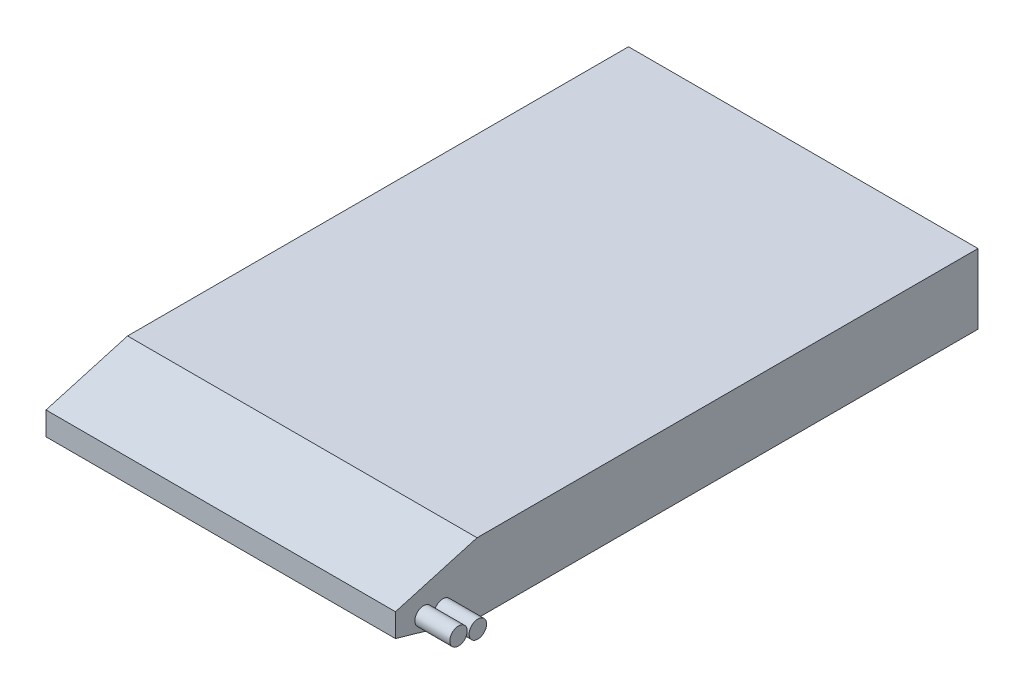
ISO-10303-21;
HEADER;
FILE_DESCRIPTION(('STEP AP214'),'2;1');
FILE_NAME('part.step','',(''),(''),'','','');
FILE_SCHEMA(('AUTOMOTIVE_DESIGN { 1 0 10303 214 1 1 1 1 }'));
ENDSEC;
DATA;
#1=APPLICATION_CONTEXT('core data for automotive mechanical design processes');
#2=APPLICATION_PROTOCOL_DEFINITION('international standard','automotive_design',2000,#1);
#3=PRODUCT_CONTEXT('',#1,'mechanical');
#4=PRODUCT('Part','Part','',(#3));
#5=PRODUCT_RELATED_PRODUCT_CATEGORY('part','',(#4));
#6=PRODUCT_DEFINITION_FORMATION('','',#4);
#7=PRODUCT_DEFINITION_CONTEXT('part definition',#1,'design');
#8=PRODUCT_DEFINITION('design','',#6,#7);
#9=PRODUCT_DEFINITION_SHAPE('','',#8);
#10=(LENGTH_UNIT() NAMED_UNIT(*) SI_UNIT(.MILLI.,.METRE.));
#11=(NAMED_UNIT(*) PLANE_ANGLE_UNIT() SI_UNIT($,.RADIAN.));
#12=(NAMED_UNIT(*) SI_UNIT($,.STERADIAN.) SOLID_ANGLE_UNIT());
#13=UNCERTAINTY_MEASURE_WITH_UNIT(LENGTH_MEASURE(1.E-05),#10,'distance_accuracy_value','');
#14=(GEOMETRIC_REPRESENTATION_CONTEXT(3) GLOBAL_UNCERTAINTY_ASSIGNED_CONTEXT((#13)) GLOBAL_UNIT_ASSIGNED_CONTEXT((#10,
#11,#12)) REPRESENTATION_CONTEXT('',''));
#15=CARTESIAN_POINT('',(0.,0.,0.));
#16=DIRECTION('',(0.,0.,1.));
#17=DIRECTION('',(1.,0.,0.));
#18=AXIS2_PLACEMENT_3D('',#15,#16,#17);
#19=CARTESIAN_POINT('',(-15.,6.,-25.));
#20=DIRECTION('',(1.,0.,0.));
#21=DIRECTION('',(0.,0.,-1.));
#22=AXIS2_PLACEMENT_3D('',#19,#20,#21);
#23=PLANE('',#22);
#24=DIRECTION('',(0.,0.,1.));
#25=VECTOR('',#24,1.);
#26=CARTESIAN_POINT('',(-15.,0.,-25.));
#27=LINE('',#26,#25);
#28=CARTESIAN_POINT('',(-15.,0.,-25.));
#29=VERTEX_POINT('',#28);
#30=CARTESIAN_POINT('',(-15.,0.,18.));
#31=VERTEX_POINT('',#30);
#32=EDGE_CURVE('E119',#29,#31,#27,.T.);
#33=ORIENTED_EDGE('',*,*,#32,.T.);
#34=DIRECTION('',(0.,-0.274721127897378,-0.961523947640823));
#35=VECTOR('',#34,1.);
#36=CARTESIAN_POINT('',(-15.,2.,25.));
#37=LINE('',#36,#35);
#38=CARTESIAN_POINT('',(-15.,2.,25.));
#39=VERTEX_POINT('',#38);
#40=EDGE_CURVE('E140',#31,#39,#37,.F.);
#41=ORIENTED_EDGE('',*,*,#40,.T.);
#42=DIRECTION('',(0.,-1.,0.));
#43=VECTOR('',#42,1.);
#44=CARTESIAN_POINT('',(-15.,6.,25.));
#45=LINE('',#44,#43);
#46=CARTESIAN_POINT('',(-15.,4.,25.));
#47=VERTEX_POINT('',#46);
#48=EDGE_CURVE('E126',#47,#39,#45,.T.);
#49=ORIENTED_EDGE('',*,*,#48,.F.);
#50=DIRECTION('',(0.,0.274721127897375,-0.961523947640824));
#51=VECTOR('',#50,1.);
#52=CARTESIAN_POINT('',(-15.,6.,17.9999999999999));
#53=LINE('',#52,#51);
#54=CARTESIAN_POINT('',(-15.,6.,17.9999999999999));
#55=VERTEX_POINT('',#54);
#56=EDGE_CURVE('E50',#47,#55,#53,.T.);
#57=ORIENTED_EDGE('',*,*,#56,.T.);
#58=DIRECTION('',(0.,0.,1.));
#59=VECTOR('',#58,1.);
#60=CARTESIAN_POINT('',(-15.,6.,-25.));
#61=LINE('',#60,#59);
#62=CARTESIAN_POINT('',(-15.,6.,-25.));
#63=VERTEX_POINT('',#62);
#64=EDGE_CURVE('E101',#63,#55,#61,.T.);
#65=ORIENTED_EDGE('',*,*,#64,.F.);
#66=DIRECTION('',(0.,-1.,0.));
#67=VECTOR('',#66,1.);
#68=CARTESIAN_POINT('',(-15.,6.,-25.));
#69=LINE('',#68,#67);
#70=EDGE_CURVE('E111',#63,#29,#69,.T.);
#71=ORIENTED_EDGE('',*,*,#70,.T.);
#72=EDGE_LOOP('',(#33,#41,#49,#57,#65,#71));
#73=FACE_BOUND('',#72,.T.);
#74=ADVANCED_FACE('F35',(#73),#23,.F.);
#75=CARTESIAN_POINT('',(-15.,6.,25.));
#76=DIRECTION('',(0.,0.,-1.));
#77=DIRECTION('',(-1.,0.,0.));
#78=AXIS2_PLACEMENT_3D('',#75,#76,#77);
#79=PLANE('',#78);
#80=ORIENTED_EDGE('',*,*,#48,.T.);
#81=DIRECTION('',(1.,0.,0.));
#82=VECTOR('',#81,1.);
#83=CARTESIAN_POINT('',(-15.,2.,25.));
#84=LINE('',#83,#82);
#85=CARTESIAN_POINT('',(15.,2.,25.));
#86=VERTEX_POINT('',#85);
#87=EDGE_CURVE('E131',#39,#86,#84,.T.);
#88=ORIENTED_EDGE('',*,*,#87,.T.);
#89=DIRECTION('',(0.,-1.,0.));
#90=VECTOR('',#89,1.);
#91=CARTESIAN_POINT('',(15.,6.,25.));
#92=LINE('',#91,#90);
#93=CARTESIAN_POINT('',(15.,4.,25.));
#94=VERTEX_POINT('',#93);
#95=EDGE_CURVE('E110',#94,#86,#92,.T.);
#96=ORIENTED_EDGE('',*,*,#95,.F.);
#97=DIRECTION('',(-1.,0.,0.));
#98=VECTOR('',#97,1.);
#99=CARTESIAN_POINT('',(-15.,4.,25.));
#100=LINE('',#99,#98);
#101=EDGE_CURVE('E129',#94,#47,#100,.T.);
#102=ORIENTED_EDGE('',*,*,#101,.T.);
#103=EDGE_LOOP('',(#80,#88,#96,#102));
#104=FACE_BOUND('',#103,.T.);
#105=ADVANCED_FACE('F148',(#104),#79,.F.);
#106=CARTESIAN_POINT('',(15.,6.,-25.));
#107=DIRECTION('',(-1.,0.,0.));
#108=DIRECTION('',(0.,0.,1.));
#109=AXIS2_PLACEMENT_3D('',#106,#107,#108);
#110=PLANE('',#109);
#111=CARTESIAN_POINT('',(15.,2.17797938182711,20.9306911355394));
#112=DIRECTION('',(-1.,0.,0.));
#113=DIRECTION('',(0.,0.,1.));
#114=AXIS2_PLACEMENT_3D('',#111,#112,#113);
#115=CIRCLE('',#114,0.750000000000002);
#116=CARTESIAN_POINT('',(15.,2.17797938182711,21.6806911355394));
#117=VERTEX_POINT('',#116);
#118=EDGE_CURVE('E11',#117,#117,#115,.F.);
#119=ORIENTED_EDGE('',*,*,#118,.F.);
#120=EDGE_LOOP('',(#119));
#121=FACE_BOUND('',#120,.T.);
#122=CARTESIAN_POINT('',(15.,2.49197493242187,22.5918288870729));
#123=DIRECTION('',(-1.,0.,0.));
#124=DIRECTION('',(0.,0.,1.));
#125=AXIS2_PLACEMENT_3D('',#122,#123,#124);
#126=CIRCLE('',#125,0.750000000000002);
#127=CARTESIAN_POINT('',(15.,2.49197493242187,23.3418288870729));
#128=VERTEX_POINT('',#127);
#129=EDGE_CURVE('E43',#128,#128,#126,.F.);
#130=ORIENTED_EDGE('',*,*,#129,.F.);
#131=EDGE_LOOP('',(#130));
#132=FACE_BOUND('',#131,.T.);
#133=ORIENTED_EDGE('',*,*,#95,.T.);
#134=DIRECTION('',(0.,0.274721127897378,0.961523947640823));
#135=VECTOR('',#134,1.);
#136=CARTESIAN_POINT('',(15.,2.,25.));
#137=LINE('',#136,#135);
#138=CARTESIAN_POINT('',(15.,0.,18.));
#139=VERTEX_POINT('',#138);
#140=EDGE_CURVE('E136',#86,#139,#137,.F.);
#141=ORIENTED_EDGE('',*,*,#140,.T.);
#142=DIRECTION('',(0.,0.,-1.));
#143=VECTOR('',#142,1.);
#144=CARTESIAN_POINT('',(15.,0.,-25.));
#145=LINE('',#144,#143);
#146=CARTESIAN_POINT('',(15.,0.,-25.));
#147=VERTEX_POINT('',#146);
#148=EDGE_CURVE('E107',#139,#147,#145,.T.);
#149=ORIENTED_EDGE('',*,*,#148,.T.);
#150=DIRECTION('',(0.,-1.,0.));
#151=VECTOR('',#150,1.);
#152=CARTESIAN_POINT('',(15.,6.,-25.));
#153=LINE('',#152,#151);
#154=CARTESIAN_POINT('',(15.,6.,-25.));
#155=VERTEX_POINT('',#154);
#156=EDGE_CURVE('E104',#155,#147,#153,.T.);
#157=ORIENTED_EDGE('',*,*,#156,.F.);
#158=DIRECTION('',(0.,0.,-1.));
#159=VECTOR('',#158,1.);
#160=CARTESIAN_POINT('',(15.,6.,-25.));
#161=LINE('',#160,#159);
#162=CARTESIAN_POINT('',(15.,6.,17.9999999999999));
#163=VERTEX_POINT('',#162);
#164=EDGE_CURVE('E92',#163,#155,#161,.T.);
#165=ORIENTED_EDGE('',*,*,#164,.F.);
#166=DIRECTION('',(0.,-0.274721127897375,0.961523947640824));
#167=VECTOR('',#166,1.);
#168=CARTESIAN_POINT('',(15.,6.,17.9999999999999));
#169=LINE('',#168,#167);
#170=EDGE_CURVE('E134',#163,#94,#169,.T.);
#171=ORIENTED_EDGE('',*,*,#170,.T.);
#172=EDGE_LOOP('',(#133,#141,#149,#157,#165,#171));
#173=FACE_BOUND('',#172,.T.);
#174=ADVANCED_FACE('F106',(#121,#132,#173),#110,.F.);
#175=CARTESIAN_POINT('',(-15.,6.,-25.));
#176=DIRECTION('',(0.,0.,1.));
#177=DIRECTION('',(1.,0.,0.));
#178=AXIS2_PLACEMENT_3D('',#175,#176,#177);
#179=PLANE('',#178);
#180=DIRECTION('',(-1.,0.,0.));
#181=VECTOR('',#180,1.);
#182=CARTESIAN_POINT('',(-15.,0.,-25.));
#183=LINE('',#182,#181);
#184=EDGE_CURVE('E123',#147,#29,#183,.T.);
#185=ORIENTED_EDGE('',*,*,#184,.T.);
#186=ORIENTED_EDGE('',*,*,#70,.F.);
#187=DIRECTION('',(-1.,0.,0.));
#188=VECTOR('',#187,1.);
#189=CARTESIAN_POINT('',(-15.,6.,-25.));
#190=LINE('',#189,#188);
#191=EDGE_CURVE('E96',#155,#63,#190,.T.);
#192=ORIENTED_EDGE('',*,*,#191,.F.);
#193=ORIENTED_EDGE('',*,*,#156,.T.);
#194=EDGE_LOOP('',(#185,#186,#192,#193));
#195=FACE_BOUND('',#194,.T.);
#196=ADVANCED_FACE('F113',(#195),#179,.F.);
#197=CARTESIAN_POINT('',(0.,6.,0.));
#198=DIRECTION('',(0.,1.,0.));
#199=DIRECTION('',(0.,0.,1.));
#200=AXIS2_PLACEMENT_3D('',#197,#198,#199);
#201=PLANE('',#200);
#202=ORIENTED_EDGE('',*,*,#64,.T.);
#203=DIRECTION('',(1.,0.,0.));
#204=VECTOR('',#203,1.);
#205=CARTESIAN_POINT('',(15.,6.,17.9999999999999));
#206=LINE('',#205,#204);
#207=EDGE_CURVE('E99',#55,#163,#206,.T.);
#208=ORIENTED_EDGE('',*,*,#207,.T.);
#209=ORIENTED_EDGE('',*,*,#164,.T.);
#210=ORIENTED_EDGE('',*,*,#191,.T.);
#211=EDGE_LOOP('',(#202,#208,#209,#210));
#212=FACE_BOUND('',#211,.T.);
#213=ADVANCED_FACE('F94',(#212),#201,.T.);
#214=CARTESIAN_POINT('',(0.,0.,0.));
#215=DIRECTION('',(0.,1.,0.));
#216=DIRECTION('',(0.,0.,1.));
#217=AXIS2_PLACEMENT_3D('',#214,#215,#216);
#218=PLANE('',#217);
#219=ORIENTED_EDGE('',*,*,#148,.F.);
#220=DIRECTION('',(-1.,0.,0.));
#221=VECTOR('',#220,1.);
#222=CARTESIAN_POINT('',(0.,0.,18.));
#223=LINE('',#222,#221);
#224=EDGE_CURVE('E58',#139,#31,#223,.T.);
#225=ORIENTED_EDGE('',*,*,#224,.T.);
#226=ORIENTED_EDGE('',*,*,#32,.F.);
#227=ORIENTED_EDGE('',*,*,#184,.F.);
#228=EDGE_LOOP('',(#219,#225,#226,#227));
#229=FACE_BOUND('',#228,.T.);
#230=ADVANCED_FACE('F165',(#229),#218,.F.);
#231=CARTESIAN_POINT('',(-15.,2.,25.));
#232=DIRECTION('',(0.,0.961523947640823,-0.274721127897378));
#233=DIRECTION('',(1.,0.,0.));
#234=AXIS2_PLACEMENT_3D('',#231,#232,#233);
#235=PLANE('',#234);
#236=ORIENTED_EDGE('',*,*,#40,.F.);
#237=ORIENTED_EDGE('',*,*,#224,.F.);
#238=ORIENTED_EDGE('',*,*,#140,.F.);
#239=ORIENTED_EDGE('',*,*,#87,.F.);
#240=EDGE_LOOP('',(#236,#237,#238,#239));
#241=FACE_BOUND('',#240,.T.);
#242=ADVANCED_FACE('F163',(#241),#235,.F.);
#243=CARTESIAN_POINT('',(0.,6.,17.9999999999999));
#244=DIRECTION('',(0.,0.961523947640824,0.274721127897375));
#245=DIRECTION('',(-1.,0.,0.));
#246=AXIS2_PLACEMENT_3D('',#243,#244,#245);
#247=PLANE('',#246);
#248=ORIENTED_EDGE('',*,*,#56,.F.);
#249=ORIENTED_EDGE('',*,*,#101,.F.);
#250=ORIENTED_EDGE('',*,*,#170,.F.);
#251=ORIENTED_EDGE('',*,*,#207,.F.);
#252=EDGE_LOOP('',(#248,#249,#250,#251));
#253=FACE_BOUND('',#252,.T.);
#254=ADVANCED_FACE('F37',(#253),#247,.T.);
#255=CARTESIAN_POINT('',(18.,2.49197493242187,22.5918288870729));
#256=DIRECTION('',(-1.,0.,0.));
#257=DIRECTION('',(0.,0.,1.));
#258=AXIS2_PLACEMENT_3D('',#255,#256,#257);
#259=CYLINDRICAL_SURFACE('',#258,0.750000000000002);
#260=CARTESIAN_POINT('',(18.,2.49197493242187,22.5918288870729));
#261=DIRECTION('',(1.,0.,0.));
#262=DIRECTION('',(0.,0.,-1.));
#263=AXIS2_PLACEMENT_3D('',#260,#261,#262);
#264=CIRCLE('',#263,0.750000000000002);
#265=CARTESIAN_POINT('',(18.,2.49197493242187,21.8418288870729));
#266=VERTEX_POINT('',#265);
#267=EDGE_CURVE('E121',#266,#266,#264,.T.);
#268=ORIENTED_EDGE('',*,*,#267,.F.);
#269=EDGE_LOOP('',(#268));
#270=FACE_BOUND('',#269,.T.);
#271=ORIENTED_EDGE('',*,*,#129,.T.);
#272=EDGE_LOOP('',(#271));
#273=FACE_BOUND('',#272,.T.);
#274=ADVANCED_FACE('F145',(#270,#273),#259,.T.);
#275=CARTESIAN_POINT('',(18.,2.49197493242187,22.5918288870729));
#276=DIRECTION('',(1.,0.,0.));
#277=DIRECTION('',(0.,0.,-1.));
#278=AXIS2_PLACEMENT_3D('',#275,#276,#277);
#279=PLANE('',#278);
#280=ORIENTED_EDGE('',*,*,#267,.T.);
#281=EDGE_LOOP('',(#280));
#282=FACE_BOUND('',#281,.T.);
#283=ADVANCED_FACE('F189',(#282),#279,.T.);
#284=CARTESIAN_POINT('',(18.,2.17797938182711,20.9306911355394));
#285=DIRECTION('',(-1.,0.,0.));
#286=DIRECTION('',(0.,0.,1.));
#287=AXIS2_PLACEMENT_3D('',#284,#285,#286);
#288=CYLINDRICAL_SURFACE('',#287,0.750000000000002);
#289=CARTESIAN_POINT('',(18.,2.17797938182711,20.9306911355394));
#290=DIRECTION('',(1.,0.,0.));
#291=DIRECTION('',(0.,0.,-1.));
#292=AXIS2_PLACEMENT_3D('',#289,#290,#291);
#293=CIRCLE('',#292,0.750000000000002);
#294=CARTESIAN_POINT('',(18.,2.17797938182711,20.1806911355394));
#295=VERTEX_POINT('',#294);
#296=EDGE_CURVE('E180',#295,#295,#293,.T.);
#297=ORIENTED_EDGE('',*,*,#296,.F.);
#298=EDGE_LOOP('',(#297));
#299=FACE_BOUND('',#298,.T.);
#300=ORIENTED_EDGE('',*,*,#118,.T.);
#301=EDGE_LOOP('',(#300));
#302=FACE_BOUND('',#301,.T.);
#303=ADVANCED_FACE('F186',(#299,#302),#288,.T.);
#304=CARTESIAN_POINT('',(18.,2.17797938182711,20.9306911355394));
#305=DIRECTION('',(1.,0.,0.));
#306=DIRECTION('',(0.,0.,-1.));
#307=AXIS2_PLACEMENT_3D('',#304,#305,#306);
#308=PLANE('',#307);
#309=ORIENTED_EDGE('',*,*,#296,.T.);
#310=EDGE_LOOP('',(#309));
#311=FACE_BOUND('',#310,.T.);
#312=ADVANCED_FACE('F184',(#311),#308,.T.);
#313=CLOSED_SHELL('',(#74,#105,#174,#196,#213,#230,#242,#254,#274,#283,#303,#312));
#314=MANIFOLD_SOLID_BREP('B2',#313);
#315=ADVANCED_BREP_SHAPE_REPRESENTATION('',(#18,#314),#14);
#316=SHAPE_DEFINITION_REPRESENTATION(#9,#315);
ENDSEC;
END-ISO-10303-21;
